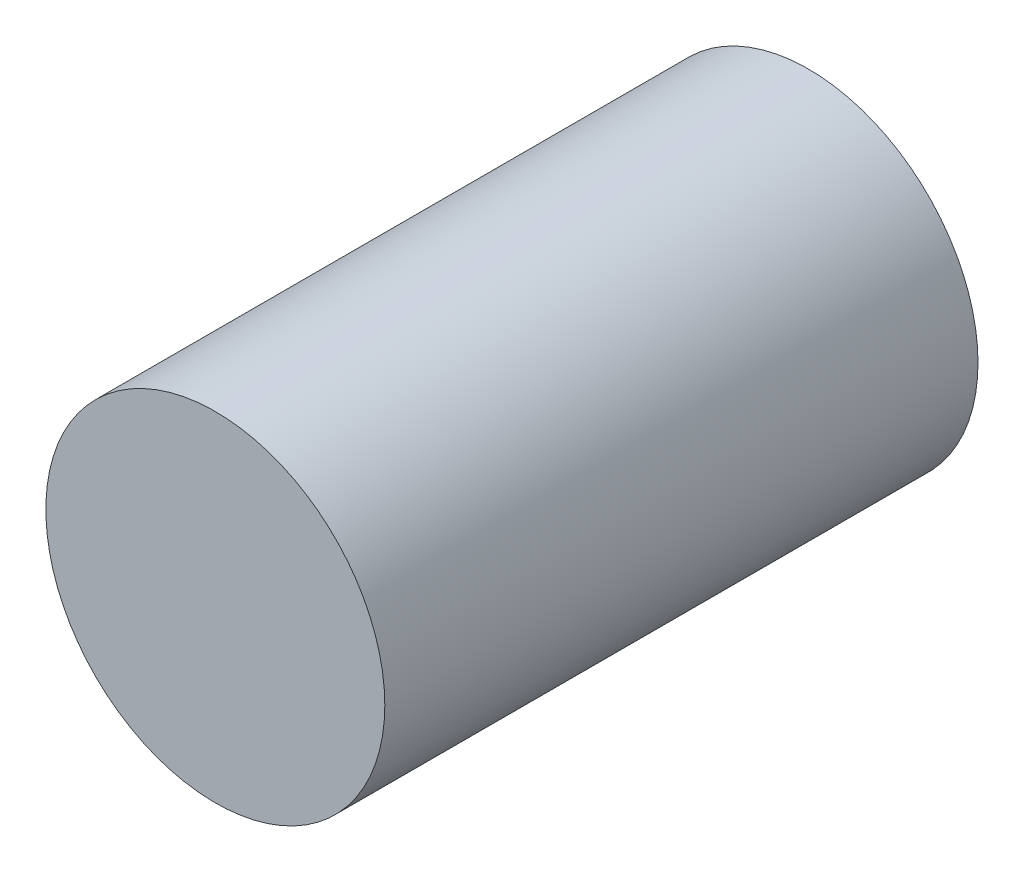
ISO-10303-21;
HEADER;
FILE_DESCRIPTION(('STEP AP214'),'2;1');
FILE_NAME('part.step','',(''),(''),'','','');
FILE_SCHEMA(('AUTOMOTIVE_DESIGN { 1 0 10303 214 1 1 1 1 }'));
ENDSEC;
DATA;
#1=APPLICATION_CONTEXT('core data for automotive mechanical design processes');
#2=APPLICATION_PROTOCOL_DEFINITION('international standard','automotive_design',2000,#1);
#3=PRODUCT_CONTEXT('',#1,'mechanical');
#4=PRODUCT('Part','Part','',(#3));
#5=PRODUCT_RELATED_PRODUCT_CATEGORY('part','',(#4));
#6=PRODUCT_DEFINITION_FORMATION('','',#4);
#7=PRODUCT_DEFINITION_CONTEXT('part definition',#1,'design');
#8=PRODUCT_DEFINITION('design','',#6,#7);
#9=PRODUCT_DEFINITION_SHAPE('','',#8);
#10=(LENGTH_UNIT() NAMED_UNIT(*) SI_UNIT(.MILLI.,.METRE.));
#11=(NAMED_UNIT(*) PLANE_ANGLE_UNIT() SI_UNIT($,.RADIAN.));
#12=(NAMED_UNIT(*) SI_UNIT($,.STERADIAN.) SOLID_ANGLE_UNIT());
#13=UNCERTAINTY_MEASURE_WITH_UNIT(LENGTH_MEASURE(1.E-05),#10,'distance_accuracy_value','');
#14=(GEOMETRIC_REPRESENTATION_CONTEXT(3) GLOBAL_UNCERTAINTY_ASSIGNED_CONTEXT((#13)) GLOBAL_UNIT_ASSIGNED_CONTEXT((#10,
#11,#12)) REPRESENTATION_CONTEXT('',''));
#15=CARTESIAN_POINT('',(0.,0.,0.));
#16=DIRECTION('',(0.,0.,1.));
#17=DIRECTION('',(1.,0.,0.));
#18=AXIS2_PLACEMENT_3D('',#15,#16,#17);
#19=CARTESIAN_POINT('',(-8.21928899948832,0.,17.78));
#20=DIRECTION('',(0.,0.,-1.));
#21=DIRECTION('',(-1.,0.,0.));
#22=AXIS2_PLACEMENT_3D('',#19,#20,#21);
#23=CYLINDRICAL_SURFACE('',#22,5.08);
#24=CARTESIAN_POINT('',(-8.21928899948832,0.,17.78));
#25=DIRECTION('',(0.,0.,1.));
#26=DIRECTION('',(1.,0.,0.));
#27=AXIS2_PLACEMENT_3D('',#24,#25,#26);
#28=CIRCLE('',#27,5.08);
#29=CARTESIAN_POINT('',(-3.13928899948831,0.,17.78));
#30=VERTEX_POINT('',#29);
#31=EDGE_CURVE('E10',#30,#30,#28,.T.);
#32=ORIENTED_EDGE('',*,*,#31,.F.);
#33=EDGE_LOOP('',(#32));
#34=FACE_BOUND('',#33,.T.);
#35=CARTESIAN_POINT('',(-8.21928899948832,0.,0.));
#36=DIRECTION('',(0.,0.,1.));
#37=DIRECTION('',(1.,0.,0.));
#38=AXIS2_PLACEMENT_3D('',#35,#36,#37);
#39=CIRCLE('',#38,5.08);
#40=CARTESIAN_POINT('',(-3.13928899948831,0.,0.));
#41=VERTEX_POINT('',#40);
#42=EDGE_CURVE('E33',#41,#41,#39,.T.);
#43=ORIENTED_EDGE('',*,*,#42,.T.);
#44=EDGE_LOOP('',(#43));
#45=FACE_BOUND('',#44,.T.);
#46=ADVANCED_FACE('F30',(#34,#45),#23,.T.);
#47=CARTESIAN_POINT('',(-8.21928899948832,0.,17.78));
#48=DIRECTION('',(0.,0.,1.));
#49=DIRECTION('',(1.,0.,0.));
#50=AXIS2_PLACEMENT_3D('',#47,#48,#49);
#51=PLANE('',#50);
#52=ORIENTED_EDGE('',*,*,#31,.T.);
#53=EDGE_LOOP('',(#52));
#54=FACE_BOUND('',#53,.T.);
#55=ADVANCED_FACE('F45',(#54),#51,.T.);
#56=CARTESIAN_POINT('',(-8.21928899948832,0.,0.));
#57=DIRECTION('',(0.,0.,1.));
#58=DIRECTION('',(1.,0.,0.));
#59=AXIS2_PLACEMENT_3D('',#56,#57,#58);
#60=PLANE('',#59);
#61=ORIENTED_EDGE('',*,*,#42,.F.);
#62=EDGE_LOOP('',(#61));
#63=FACE_BOUND('',#62,.T.);
#64=ADVANCED_FACE('F43',(#63),#60,.F.);
#65=CLOSED_SHELL('',(#46,#55,#64));
#66=MANIFOLD_SOLID_BREP('B2',#65);
#67=ADVANCED_BREP_SHAPE_REPRESENTATION('',(#18,#66),#14);
#68=SHAPE_DEFINITION_REPRESENTATION(#9,#67);
ENDSEC;
END-ISO-10303-21;
